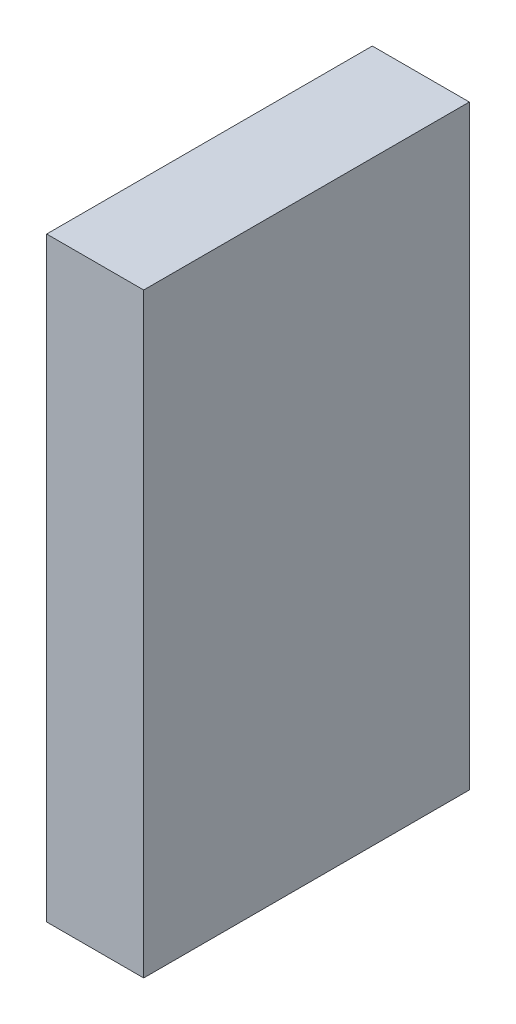
ISO-10303-21;
HEADER;
FILE_DESCRIPTION(('STEP AP214'),'2;1');
FILE_NAME('part.step','',(''),(''),'','','');
FILE_SCHEMA(('AUTOMOTIVE_DESIGN { 1 0 10303 214 1 1 1 1 }'));
ENDSEC;
DATA;
#1=APPLICATION_CONTEXT('core data for automotive mechanical design processes');
#2=APPLICATION_PROTOCOL_DEFINITION('international standard','automotive_design',2000,#1);
#3=PRODUCT_CONTEXT('',#1,'mechanical');
#4=PRODUCT('Part','Part','',(#3));
#5=PRODUCT_RELATED_PRODUCT_CATEGORY('part','',(#4));
#6=PRODUCT_DEFINITION_FORMATION('','',#4);
#7=PRODUCT_DEFINITION_CONTEXT('part definition',#1,'design');
#8=PRODUCT_DEFINITION('design','',#6,#7);
#9=PRODUCT_DEFINITION_SHAPE('','',#8);
#10=(LENGTH_UNIT() NAMED_UNIT(*) SI_UNIT(.MILLI.,.METRE.));
#11=(NAMED_UNIT(*) PLANE_ANGLE_UNIT() SI_UNIT($,.RADIAN.));
#12=(NAMED_UNIT(*) SI_UNIT($,.STERADIAN.) SOLID_ANGLE_UNIT());
#13=UNCERTAINTY_MEASURE_WITH_UNIT(LENGTH_MEASURE(1.E-05),#10,'distance_accuracy_value','');
#14=(GEOMETRIC_REPRESENTATION_CONTEXT(3) GLOBAL_UNCERTAINTY_ASSIGNED_CONTEXT((#13)) GLOBAL_UNIT_ASSIGNED_CONTEXT((#10,
#11,#12)) REPRESENTATION_CONTEXT('',''));
#15=CARTESIAN_POINT('',(0.,0.,0.));
#16=DIRECTION('',(0.,0.,1.));
#17=DIRECTION('',(1.,0.,0.));
#18=AXIS2_PLACEMENT_3D('',#15,#16,#17);
#19=CARTESIAN_POINT('',(0.35,-2.14999999999999,2.35));
#20=DIRECTION('',(-1.,0.,0.));
#21=DIRECTION('',(0.,0.,1.));
#22=AXIS2_PLACEMENT_3D('',#19,#20,#21);
#23=PLANE('',#22);
#24=DIRECTION('',(0.,1.,0.));
#25=VECTOR('',#24,1.);
#26=CARTESIAN_POINT('',(0.35,-2.14999999999999,0.));
#27=LINE('',#26,#25);
#28=CARTESIAN_POINT('',(0.35,-2.14999999999999,0.));
#29=VERTEX_POINT('',#28);
#30=CARTESIAN_POINT('',(0.35,2.15000000000001,0.));
#31=VERTEX_POINT('',#30);
#32=EDGE_CURVE('E96',#29,#31,#27,.T.);
#33=ORIENTED_EDGE('',*,*,#32,.T.);
#34=DIRECTION('',(0.,0.,-1.));
#35=VECTOR('',#34,1.);
#36=CARTESIAN_POINT('',(0.35,2.15000000000001,2.35));
#37=LINE('',#36,#35);
#38=CARTESIAN_POINT('',(0.35,2.15000000000001,2.35));
#39=VERTEX_POINT('',#38);
#40=EDGE_CURVE('E11',#39,#31,#37,.T.);
#41=ORIENTED_EDGE('',*,*,#40,.F.);
#42=DIRECTION('',(0.,1.,0.));
#43=VECTOR('',#42,1.);
#44=CARTESIAN_POINT('',(0.35,-2.14999999999999,2.35));
#45=LINE('',#44,#43);
#46=CARTESIAN_POINT('',(0.35,-2.14999999999999,2.35));
#47=VERTEX_POINT('',#46);
#48=EDGE_CURVE('E84',#47,#39,#45,.T.);
#49=ORIENTED_EDGE('',*,*,#48,.F.);
#50=DIRECTION('',(0.,0.,-1.));
#51=VECTOR('',#50,1.);
#52=CARTESIAN_POINT('',(0.35,-2.14999999999999,2.35));
#53=LINE('',#52,#51);
#54=EDGE_CURVE('E92',#47,#29,#53,.T.);
#55=ORIENTED_EDGE('',*,*,#54,.T.);
#56=EDGE_LOOP('',(#33,#41,#49,#55));
#57=FACE_BOUND('',#56,.T.);
#58=ADVANCED_FACE('F33',(#57),#23,.F.);
#59=CARTESIAN_POINT('',(-0.349999999999999,2.15000000000001,2.35));
#60=DIRECTION('',(0.,-1.,0.));
#61=DIRECTION('',(0.,0.,-1.));
#62=AXIS2_PLACEMENT_3D('',#59,#60,#61);
#63=PLANE('',#62);
#64=DIRECTION('',(-1.,0.,0.));
#65=VECTOR('',#64,1.);
#66=CARTESIAN_POINT('',(-0.349999999999999,2.15000000000001,0.));
#67=LINE('',#66,#65);
#68=CARTESIAN_POINT('',(-0.349999999999999,2.15000000000001,0.));
#69=VERTEX_POINT('',#68);
#70=EDGE_CURVE('E88',#31,#69,#67,.T.);
#71=ORIENTED_EDGE('',*,*,#70,.T.);
#72=DIRECTION('',(0.,0.,-1.));
#73=VECTOR('',#72,1.);
#74=CARTESIAN_POINT('',(-0.349999999999999,2.15000000000001,2.35));
#75=LINE('',#74,#73);
#76=CARTESIAN_POINT('',(-0.349999999999999,2.15000000000001,2.35));
#77=VERTEX_POINT('',#76);
#78=EDGE_CURVE('E41',#77,#69,#75,.T.);
#79=ORIENTED_EDGE('',*,*,#78,.F.);
#80=DIRECTION('',(-1.,0.,0.));
#81=VECTOR('',#80,1.);
#82=CARTESIAN_POINT('',(-0.349999999999999,2.15000000000001,2.35));
#83=LINE('',#82,#81);
#84=EDGE_CURVE('E79',#39,#77,#83,.T.);
#85=ORIENTED_EDGE('',*,*,#84,.F.);
#86=ORIENTED_EDGE('',*,*,#40,.T.);
#87=EDGE_LOOP('',(#71,#79,#85,#86));
#88=FACE_BOUND('',#87,.T.);
#89=ADVANCED_FACE('F87',(#88),#63,.F.);
#90=CARTESIAN_POINT('',(-0.349999999999999,-2.14999999999999,2.35));
#91=DIRECTION('',(1.,0.,0.));
#92=DIRECTION('',(0.,0.,-1.));
#93=AXIS2_PLACEMENT_3D('',#90,#91,#92);
#94=PLANE('',#93);
#95=DIRECTION('',(0.,-1.,0.));
#96=VECTOR('',#95,1.);
#97=CARTESIAN_POINT('',(-0.349999999999999,-2.14999999999999,0.));
#98=LINE('',#97,#96);
#99=CARTESIAN_POINT('',(-0.349999999999999,-2.14999999999999,0.));
#100=VERTEX_POINT('',#99);
#101=EDGE_CURVE('E66',#69,#100,#98,.T.);
#102=ORIENTED_EDGE('',*,*,#101,.T.);
#103=DIRECTION('',(0.,0.,-1.));
#104=VECTOR('',#103,1.);
#105=CARTESIAN_POINT('',(-0.349999999999999,-2.14999999999999,2.35));
#106=LINE('',#105,#104);
#107=CARTESIAN_POINT('',(-0.349999999999999,-2.14999999999999,2.35));
#108=VERTEX_POINT('',#107);
#109=EDGE_CURVE('E89',#108,#100,#106,.T.);
#110=ORIENTED_EDGE('',*,*,#109,.F.);
#111=DIRECTION('',(0.,-1.,0.));
#112=VECTOR('',#111,1.);
#113=CARTESIAN_POINT('',(-0.349999999999999,-2.14999999999999,2.35));
#114=LINE('',#113,#112);
#115=EDGE_CURVE('E82',#77,#108,#114,.T.);
#116=ORIENTED_EDGE('',*,*,#115,.F.);
#117=ORIENTED_EDGE('',*,*,#78,.T.);
#118=EDGE_LOOP('',(#102,#110,#116,#117));
#119=FACE_BOUND('',#118,.T.);
#120=ADVANCED_FACE('F90',(#119),#94,.F.);
#121=CARTESIAN_POINT('',(-0.349999999999999,-2.14999999999999,2.35));
#122=DIRECTION('',(0.,1.,0.));
#123=DIRECTION('',(0.,0.,1.));
#124=AXIS2_PLACEMENT_3D('',#121,#122,#123);
#125=PLANE('',#124);
#126=DIRECTION('',(1.,0.,0.));
#127=VECTOR('',#126,1.);
#128=CARTESIAN_POINT('',(-0.349999999999999,-2.14999999999999,0.));
#129=LINE('',#128,#127);
#130=EDGE_CURVE('E72',#100,#29,#129,.T.);
#131=ORIENTED_EDGE('',*,*,#130,.T.);
#132=ORIENTED_EDGE('',*,*,#54,.F.);
#133=DIRECTION('',(1.,0.,0.));
#134=VECTOR('',#133,1.);
#135=CARTESIAN_POINT('',(-0.349999999999999,-2.14999999999999,2.35));
#136=LINE('',#135,#134);
#137=EDGE_CURVE('E49',#108,#47,#136,.T.);
#138=ORIENTED_EDGE('',*,*,#137,.F.);
#139=ORIENTED_EDGE('',*,*,#109,.T.);
#140=EDGE_LOOP('',(#131,#132,#138,#139));
#141=FACE_BOUND('',#140,.T.);
#142=ADVANCED_FACE('F103',(#141),#125,.F.);
#143=CARTESIAN_POINT('',(0.,0.,2.35));
#144=DIRECTION('',(0.,0.,-1.));
#145=DIRECTION('',(-1.,0.,0.));
#146=AXIS2_PLACEMENT_3D('',#143,#144,#145);
#147=PLANE('',#146);
#148=ORIENTED_EDGE('',*,*,#48,.T.);
#149=ORIENTED_EDGE('',*,*,#84,.T.);
#150=ORIENTED_EDGE('',*,*,#115,.T.);
#151=ORIENTED_EDGE('',*,*,#137,.T.);
#152=EDGE_LOOP('',(#148,#149,#150,#151));
#153=FACE_BOUND('',#152,.T.);
#154=ADVANCED_FACE('F80',(#153),#147,.F.);
#155=CARTESIAN_POINT('',(0.,0.,0.));
#156=DIRECTION('',(0.,0.,-1.));
#157=DIRECTION('',(-1.,0.,0.));
#158=AXIS2_PLACEMENT_3D('',#155,#156,#157);
#159=PLANE('',#158);
#160=ORIENTED_EDGE('',*,*,#32,.F.);
#161=ORIENTED_EDGE('',*,*,#130,.F.);
#162=ORIENTED_EDGE('',*,*,#101,.F.);
#163=ORIENTED_EDGE('',*,*,#70,.F.);
#164=EDGE_LOOP('',(#160,#161,#162,#163));
#165=FACE_BOUND('',#164,.T.);
#166=ADVANCED_FACE('F106',(#165),#159,.T.);
#167=CLOSED_SHELL('',(#58,#89,#120,#142,#154,#166));
#168=MANIFOLD_SOLID_BREP('B2',#167);
#169=ADVANCED_BREP_SHAPE_REPRESENTATION('',(#18,#168),#14);
#170=SHAPE_DEFINITION_REPRESENTATION(#9,#169);
ENDSEC;
END-ISO-10303-21;
